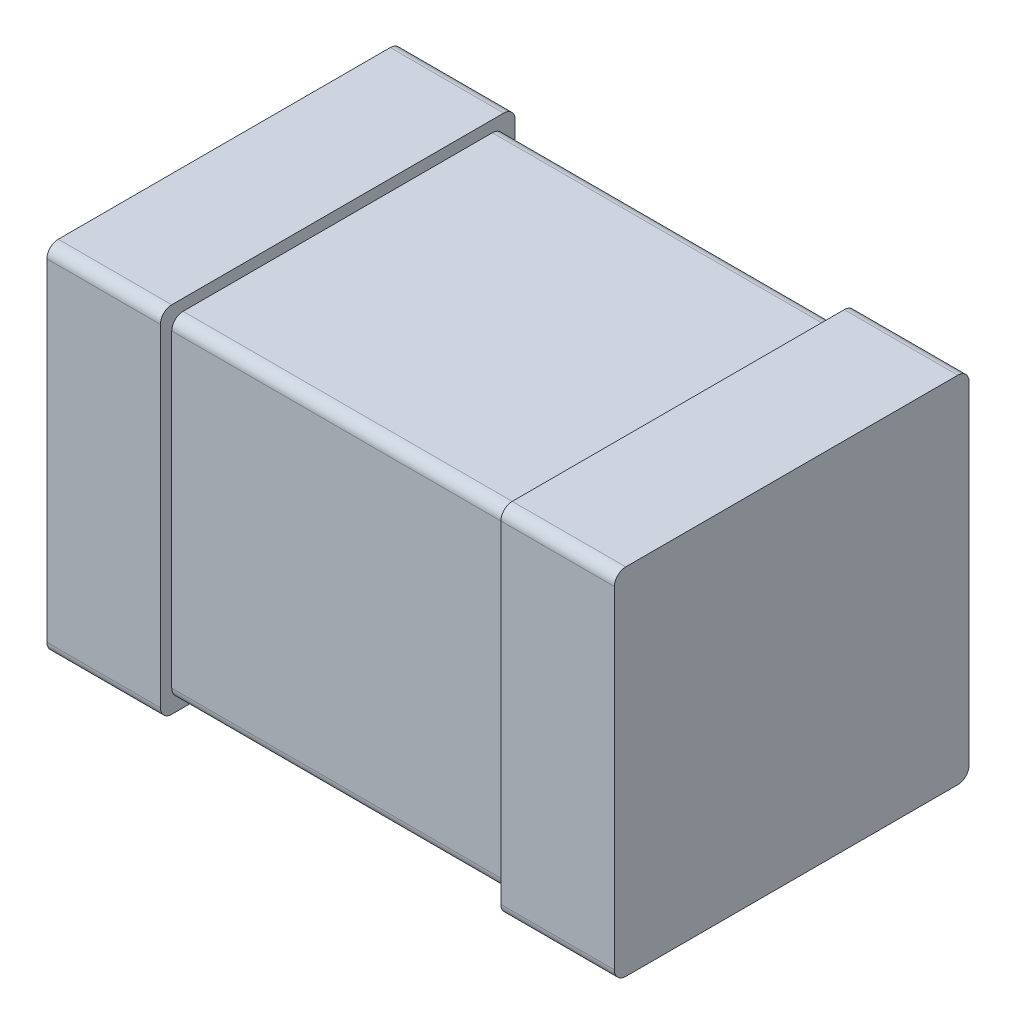
ISO-10303-21;
HEADER;
FILE_DESCRIPTION(('STEP AP214'),'2;1');
FILE_NAME('part.step','',(''),(''),'','','');
FILE_SCHEMA(('AUTOMOTIVE_DESIGN { 1 0 10303 214 1 1 1 1 }'));
ENDSEC;
DATA;
#1=APPLICATION_CONTEXT('core data for automotive mechanical design processes');
#2=APPLICATION_PROTOCOL_DEFINITION('international standard','automotive_design',2000,#1);
#3=PRODUCT_CONTEXT('',#1,'mechanical');
#4=PRODUCT('Part','Part','',(#3));
#5=PRODUCT_RELATED_PRODUCT_CATEGORY('part','',(#4));
#6=PRODUCT_DEFINITION_FORMATION('','',#4);
#7=PRODUCT_DEFINITION_CONTEXT('part definition',#1,'design');
#8=PRODUCT_DEFINITION('design','',#6,#7);
#9=PRODUCT_DEFINITION_SHAPE('','',#8);
#10=(LENGTH_UNIT() NAMED_UNIT(*) SI_UNIT(.MILLI.,.METRE.));
#11=(NAMED_UNIT(*) PLANE_ANGLE_UNIT() SI_UNIT($,.RADIAN.));
#12=(NAMED_UNIT(*) SI_UNIT($,.STERADIAN.) SOLID_ANGLE_UNIT());
#13=UNCERTAINTY_MEASURE_WITH_UNIT(LENGTH_MEASURE(1.E-05),#10,'distance_accuracy_value','');
#14=(GEOMETRIC_REPRESENTATION_CONTEXT(3) GLOBAL_UNCERTAINTY_ASSIGNED_CONTEXT((#13)) GLOBAL_UNIT_ASSIGNED_CONTEXT((#10,
#11,#12)) REPRESENTATION_CONTEXT('',''));
#15=CARTESIAN_POINT('',(0.,0.,0.));
#16=DIRECTION('',(0.,0.,1.));
#17=DIRECTION('',(1.,0.,0.));
#18=AXIS2_PLACEMENT_3D('',#15,#16,#17);
#19=CARTESIAN_POINT('',(1.,0.625,0.));
#20=DIRECTION('',(1.,0.,0.));
#21=DIRECTION('',(0.,0.,1.));
#22=AXIS2_PLACEMENT_3D('',#19,#20,#21);
#23=PLANE('',#22);
#24=DIRECTION('',(0.,1.,0.));
#25=VECTOR('',#24,1.);
#26=CARTESIAN_POINT('',(1.,0.,1.25));
#27=LINE('',#26,#25);
#28=CARTESIAN_POINT('',(1.,-0.585,1.25));
#29=VERTEX_POINT('',#28);
#30=CARTESIAN_POINT('',(1.,0.585,1.25));
#31=VERTEX_POINT('',#30);
#32=EDGE_CURVE('E201',#29,#31,#27,.T.);
#33=ORIENTED_EDGE('',*,*,#32,.F.);
#34=CARTESIAN_POINT('',(1.,-0.585,1.21));
#35=DIRECTION('',(1.,0.,0.));
#36=DIRECTION('',(0.,0.,-1.));
#37=AXIS2_PLACEMENT_3D('',#34,#35,#36);
#38=CIRCLE('',#37,0.0400000000000016);
#39=CARTESIAN_POINT('',(1.,-0.625,1.21));
#40=VERTEX_POINT('',#39);
#41=EDGE_CURVE('E188',#40,#29,#38,.F.);
#42=ORIENTED_EDGE('',*,*,#41,.F.);
#43=DIRECTION('',(0.,0.,-1.));
#44=VECTOR('',#43,1.);
#45=CARTESIAN_POINT('',(1.,-0.625,0.625));
#46=LINE('',#45,#44);
#47=CARTESIAN_POINT('',(1.,-0.625,0.04));
#48=VERTEX_POINT('',#47);
#49=EDGE_CURVE('E185',#40,#48,#46,.T.);
#50=ORIENTED_EDGE('',*,*,#49,.T.);
#51=CARTESIAN_POINT('',(1.,-0.585,0.04));
#52=DIRECTION('',(1.,0.,0.));
#53=DIRECTION('',(0.,0.,-1.));
#54=AXIS2_PLACEMENT_3D('',#51,#52,#53);
#55=CIRCLE('',#54,0.0400000000000015);
#56=CARTESIAN_POINT('',(1.,-0.585,0.));
#57=VERTEX_POINT('',#56);
#58=EDGE_CURVE('E21',#57,#48,#55,.F.);
#59=ORIENTED_EDGE('',*,*,#58,.F.);
#60=DIRECTION('',(0.,1.,0.));
#61=VECTOR('',#60,1.);
#62=CARTESIAN_POINT('',(1.,0.,0.));
#63=LINE('',#62,#61);
#64=CARTESIAN_POINT('',(1.,0.585,0.));
#65=VERTEX_POINT('',#64);
#66=EDGE_CURVE('E197',#57,#65,#63,.T.);
#67=ORIENTED_EDGE('',*,*,#66,.T.);
#68=CARTESIAN_POINT('',(1.,0.585,0.04));
#69=DIRECTION('',(1.,0.,0.));
#70=DIRECTION('',(0.,0.,-1.));
#71=AXIS2_PLACEMENT_3D('',#68,#69,#70);
#72=CIRCLE('',#71,0.0400000000000015);
#73=CARTESIAN_POINT('',(1.,0.625,0.04));
#74=VERTEX_POINT('',#73);
#75=EDGE_CURVE('E209',#74,#65,#72,.F.);
#76=ORIENTED_EDGE('',*,*,#75,.F.);
#77=DIRECTION('',(0.,0.,-1.));
#78=VECTOR('',#77,1.);
#79=CARTESIAN_POINT('',(1.,0.625,0.625));
#80=LINE('',#79,#78);
#81=CARTESIAN_POINT('',(1.,0.625,1.21));
#82=VERTEX_POINT('',#81);
#83=EDGE_CURVE('E205',#82,#74,#80,.T.);
#84=ORIENTED_EDGE('',*,*,#83,.F.);
#85=CARTESIAN_POINT('',(1.,0.585,1.21));
#86=DIRECTION('',(1.,0.,0.));
#87=DIRECTION('',(0.,0.,-1.));
#88=AXIS2_PLACEMENT_3D('',#85,#86,#87);
#89=CIRCLE('',#88,0.0400000000000016);
#90=EDGE_CURVE('E283',#31,#82,#89,.F.);
#91=ORIENTED_EDGE('',*,*,#90,.F.);
#92=EDGE_LOOP('',(#33,#42,#50,#59,#67,#76,#84,#91));
#93=FACE_BOUND('',#92,.T.);
#94=ADVANCED_FACE('F17',(#93),#23,.T.);
#95=CARTESIAN_POINT('',(0.6,-0.625,0.04));
#96=DIRECTION('',(0.,1.,0.));
#97=DIRECTION('',(0.,0.,1.));
#98=AXIS2_PLACEMENT_3D('',#95,#96,#97);
#99=PLANE('',#98);
#100=DIRECTION('',(0.,0.,-1.));
#101=VECTOR('',#100,1.);
#102=CARTESIAN_POINT('',(0.6,-0.625,0.625));
#103=LINE('',#102,#101);
#104=CARTESIAN_POINT('',(0.6,-0.625,1.21));
#105=VERTEX_POINT('',#104);
#106=CARTESIAN_POINT('',(0.6,-0.625,0.04));
#107=VERTEX_POINT('',#106);
#108=EDGE_CURVE('E195',#105,#107,#103,.T.);
#109=ORIENTED_EDGE('',*,*,#108,.T.);
#110=DIRECTION('',(-1.,0.,0.));
#111=VECTOR('',#110,1.);
#112=CARTESIAN_POINT('',(0.8,-0.625,0.04));
#113=LINE('',#112,#111);
#114=EDGE_CURVE('E182',#48,#107,#113,.T.);
#115=ORIENTED_EDGE('',*,*,#114,.F.);
#116=ORIENTED_EDGE('',*,*,#49,.F.);
#117=DIRECTION('',(1.,0.,0.));
#118=VECTOR('',#117,1.);
#119=CARTESIAN_POINT('',(0.8,-0.625,1.21));
#120=LINE('',#119,#118);
#121=EDGE_CURVE('E282',#105,#40,#120,.T.);
#122=ORIENTED_EDGE('',*,*,#121,.F.);
#123=EDGE_LOOP('',(#109,#115,#116,#122));
#124=FACE_BOUND('',#123,.T.);
#125=ADVANCED_FACE('F194',(#124),#99,.F.);
#126=CARTESIAN_POINT('',(0.6,-0.585,0.04));
#127=DIRECTION('',(1.,0.,0.));
#128=DIRECTION('',(0.,0.,-1.));
#129=AXIS2_PLACEMENT_3D('',#126,#127,#128);
#130=CYLINDRICAL_SURFACE('',#129,0.0400000000000015);
#131=ORIENTED_EDGE('',*,*,#58,.T.);
#132=ORIENTED_EDGE('',*,*,#114,.T.);
#133=CARTESIAN_POINT('',(0.6,-0.585,0.04));
#134=DIRECTION('',(1.,0.,0.));
#135=DIRECTION('',(0.,0.,-1.));
#136=AXIS2_PLACEMENT_3D('',#133,#134,#135);
#137=CIRCLE('',#136,0.0400000000000015);
#138=CARTESIAN_POINT('',(0.6,-0.585,0.));
#139=VERTEX_POINT('',#138);
#140=EDGE_CURVE('E278',#107,#139,#137,.T.);
#141=ORIENTED_EDGE('',*,*,#140,.T.);
#142=DIRECTION('',(1.,0.,0.));
#143=VECTOR('',#142,1.);
#144=CARTESIAN_POINT('',(0.8,-0.585,0.));
#145=LINE('',#144,#143);
#146=EDGE_CURVE('E184',#139,#57,#145,.T.);
#147=ORIENTED_EDGE('',*,*,#146,.T.);
#148=EDGE_LOOP('',(#131,#132,#141,#147));
#149=FACE_BOUND('',#148,.T.);
#150=ADVANCED_FACE('F179',(#149),#130,.T.);
#151=CARTESIAN_POINT('',(0.6,-0.585,0.));
#152=DIRECTION('',(0.,0.,1.));
#153=DIRECTION('',(1.,0.,0.));
#154=AXIS2_PLACEMENT_3D('',#151,#152,#153);
#155=PLANE('',#154);
#156=ORIENTED_EDGE('',*,*,#66,.F.);
#157=ORIENTED_EDGE('',*,*,#146,.F.);
#158=DIRECTION('',(0.,1.,0.));
#159=VECTOR('',#158,1.);
#160=CARTESIAN_POINT('',(0.6,0.,0.));
#161=LINE('',#160,#159);
#162=CARTESIAN_POINT('',(0.6,0.585,0.));
#163=VERTEX_POINT('',#162);
#164=EDGE_CURVE('E277',#139,#163,#161,.T.);
#165=ORIENTED_EDGE('',*,*,#164,.T.);
#166=DIRECTION('',(-1.,0.,0.));
#167=VECTOR('',#166,1.);
#168=CARTESIAN_POINT('',(0.8,0.585,0.));
#169=LINE('',#168,#167);
#170=EDGE_CURVE('E208',#65,#163,#169,.T.);
#171=ORIENTED_EDGE('',*,*,#170,.F.);
#172=EDGE_LOOP('',(#156,#157,#165,#171));
#173=FACE_BOUND('',#172,.T.);
#174=ADVANCED_FACE('F472',(#173),#155,.F.);
#175=CARTESIAN_POINT('',(0.6,0.585,0.04));
#176=DIRECTION('',(1.,0.,0.));
#177=DIRECTION('',(0.,0.,-1.));
#178=AXIS2_PLACEMENT_3D('',#175,#176,#177);
#179=CYLINDRICAL_SURFACE('',#178,0.0400000000000015);
#180=ORIENTED_EDGE('',*,*,#170,.T.);
#181=CARTESIAN_POINT('',(0.6,0.585,0.04));
#182=DIRECTION('',(1.,0.,0.));
#183=DIRECTION('',(0.,0.,-1.));
#184=AXIS2_PLACEMENT_3D('',#181,#182,#183);
#185=CIRCLE('',#184,0.0400000000000015);
#186=CARTESIAN_POINT('',(0.6,0.625,0.04));
#187=VERTEX_POINT('',#186);
#188=EDGE_CURVE('E274',#163,#187,#185,.T.);
#189=ORIENTED_EDGE('',*,*,#188,.T.);
#190=DIRECTION('',(-1.,0.,0.));
#191=VECTOR('',#190,1.);
#192=CARTESIAN_POINT('',(0.8,0.625,0.04));
#193=LINE('',#192,#191);
#194=EDGE_CURVE('E207',#74,#187,#193,.T.);
#195=ORIENTED_EDGE('',*,*,#194,.F.);
#196=ORIENTED_EDGE('',*,*,#75,.T.);
#197=EDGE_LOOP('',(#180,#189,#195,#196));
#198=FACE_BOUND('',#197,.T.);
#199=ADVANCED_FACE('F468',(#198),#179,.T.);
#200=CARTESIAN_POINT('',(0.6,0.625,0.04));
#201=DIRECTION('',(0.,1.,0.));
#202=DIRECTION('',(0.,0.,1.));
#203=AXIS2_PLACEMENT_3D('',#200,#201,#202);
#204=PLANE('',#203);
#205=DIRECTION('',(0.,0.,1.));
#206=VECTOR('',#205,1.);
#207=CARTESIAN_POINT('',(0.6,0.625,0.625));
#208=LINE('',#207,#206);
#209=CARTESIAN_POINT('',(0.6,0.625,1.21));
#210=VERTEX_POINT('',#209);
#211=EDGE_CURVE('E273',#187,#210,#208,.T.);
#212=ORIENTED_EDGE('',*,*,#211,.T.);
#213=DIRECTION('',(-1.,0.,0.));
#214=VECTOR('',#213,1.);
#215=CARTESIAN_POINT('',(0.8,0.625,1.21));
#216=LINE('',#215,#214);
#217=EDGE_CURVE('E203',#82,#210,#216,.T.);
#218=ORIENTED_EDGE('',*,*,#217,.F.);
#219=ORIENTED_EDGE('',*,*,#83,.T.);
#220=ORIENTED_EDGE('',*,*,#194,.T.);
#221=EDGE_LOOP('',(#212,#218,#219,#220));
#222=FACE_BOUND('',#221,.T.);
#223=ADVANCED_FACE('F464',(#222),#204,.T.);
#224=CARTESIAN_POINT('',(0.6,0.585,1.21));
#225=DIRECTION('',(1.,0.,0.));
#226=DIRECTION('',(0.,0.,-1.));
#227=AXIS2_PLACEMENT_3D('',#224,#225,#226);
#228=CYLINDRICAL_SURFACE('',#227,0.0400000000000016);
#229=ORIENTED_EDGE('',*,*,#90,.T.);
#230=ORIENTED_EDGE('',*,*,#217,.T.);
#231=CARTESIAN_POINT('',(0.6,0.585,1.21));
#232=DIRECTION('',(1.,0.,0.));
#233=DIRECTION('',(0.,0.,-1.));
#234=AXIS2_PLACEMENT_3D('',#231,#232,#233);
#235=CIRCLE('',#234,0.0400000000000016);
#236=CARTESIAN_POINT('',(0.6,0.585,1.25));
#237=VERTEX_POINT('',#236);
#238=EDGE_CURVE('E270',#210,#237,#235,.T.);
#239=ORIENTED_EDGE('',*,*,#238,.T.);
#240=DIRECTION('',(-1.,0.,0.));
#241=VECTOR('',#240,1.);
#242=CARTESIAN_POINT('',(0.8,0.585,1.25));
#243=LINE('',#242,#241);
#244=EDGE_CURVE('E202',#31,#237,#243,.T.);
#245=ORIENTED_EDGE('',*,*,#244,.F.);
#246=EDGE_LOOP('',(#229,#230,#239,#245));
#247=FACE_BOUND('',#246,.T.);
#248=ADVANCED_FACE('F460',(#247),#228,.T.);
#249=CARTESIAN_POINT('',(0.6,-0.585,1.25));
#250=DIRECTION('',(0.,0.,1.));
#251=DIRECTION('',(1.,0.,0.));
#252=AXIS2_PLACEMENT_3D('',#249,#250,#251);
#253=PLANE('',#252);
#254=ORIENTED_EDGE('',*,*,#32,.T.);
#255=ORIENTED_EDGE('',*,*,#244,.T.);
#256=DIRECTION('',(0.,-1.,0.));
#257=VECTOR('',#256,1.);
#258=CARTESIAN_POINT('',(0.6,0.,1.25));
#259=LINE('',#258,#257);
#260=CARTESIAN_POINT('',(0.6,-0.585,1.25));
#261=VERTEX_POINT('',#260);
#262=EDGE_CURVE('E269',#237,#261,#259,.T.);
#263=ORIENTED_EDGE('',*,*,#262,.T.);
#264=DIRECTION('',(-1.,0.,0.));
#265=VECTOR('',#264,1.);
#266=CARTESIAN_POINT('',(0.8,-0.585,1.25));
#267=LINE('',#266,#265);
#268=EDGE_CURVE('E281',#29,#261,#267,.T.);
#269=ORIENTED_EDGE('',*,*,#268,.F.);
#270=EDGE_LOOP('',(#254,#255,#263,#269));
#271=FACE_BOUND('',#270,.T.);
#272=ADVANCED_FACE('F456',(#271),#253,.T.);
#273=CARTESIAN_POINT('',(0.6,-0.585,1.21));
#274=DIRECTION('',(1.,0.,0.));
#275=DIRECTION('',(0.,0.,-1.));
#276=AXIS2_PLACEMENT_3D('',#273,#274,#275);
#277=CYLINDRICAL_SURFACE('',#276,0.0400000000000016);
#278=ORIENTED_EDGE('',*,*,#268,.T.);
#279=CARTESIAN_POINT('',(0.6,-0.585,1.21));
#280=DIRECTION('',(1.,0.,0.));
#281=DIRECTION('',(0.,0.,-1.));
#282=AXIS2_PLACEMENT_3D('',#279,#280,#281);
#283=CIRCLE('',#282,0.0400000000000016);
#284=EDGE_CURVE('E266',#261,#105,#283,.T.);
#285=ORIENTED_EDGE('',*,*,#284,.T.);
#286=ORIENTED_EDGE('',*,*,#121,.T.);
#287=ORIENTED_EDGE('',*,*,#41,.T.);
#288=EDGE_LOOP('',(#278,#285,#286,#287));
#289=FACE_BOUND('',#288,.T.);
#290=ADVANCED_FACE('F452',(#289),#277,.T.);
#291=CARTESIAN_POINT('',(0.6,0.625,0.));
#292=DIRECTION('',(1.,0.,0.));
#293=DIRECTION('',(0.,0.,1.));
#294=AXIS2_PLACEMENT_3D('',#291,#292,#293);
#295=PLANE('',#294);
#296=CARTESIAN_POINT('',(0.6,0.545,0.08));
#297=DIRECTION('',(1.,0.,0.));
#298=DIRECTION('',(0.,0.,-1.));
#299=AXIS2_PLACEMENT_3D('',#296,#297,#298);
#300=CIRCLE('',#299,0.0400000000000014);
#301=CARTESIAN_POINT('',(0.6,0.585,0.08));
#302=VERTEX_POINT('',#301);
#303=CARTESIAN_POINT('',(0.6,0.545,0.04));
#304=VERTEX_POINT('',#303);
#305=EDGE_CURVE('E251',#302,#304,#300,.F.);
#306=ORIENTED_EDGE('',*,*,#305,.F.);
#307=DIRECTION('',(0.,0.,-1.));
#308=VECTOR('',#307,1.);
#309=CARTESIAN_POINT('',(0.6,0.585,0.625));
#310=LINE('',#309,#308);
#311=CARTESIAN_POINT('',(0.6,0.585,1.17));
#312=VERTEX_POINT('',#311);
#313=EDGE_CURVE('E257',#312,#302,#310,.T.);
#314=ORIENTED_EDGE('',*,*,#313,.F.);
#315=CARTESIAN_POINT('',(0.6,0.545,1.17));
#316=DIRECTION('',(1.,0.,0.));
#317=DIRECTION('',(0.,0.,-1.));
#318=AXIS2_PLACEMENT_3D('',#315,#316,#317);
#319=CIRCLE('',#318,0.0400000000000015);
#320=CARTESIAN_POINT('',(0.6,0.545,1.21));
#321=VERTEX_POINT('',#320);
#322=EDGE_CURVE('E255',#321,#312,#319,.F.);
#323=ORIENTED_EDGE('',*,*,#322,.F.);
#324=DIRECTION('',(0.,1.,0.));
#325=VECTOR('',#324,1.);
#326=CARTESIAN_POINT('',(0.6,0.,1.21));
#327=LINE('',#326,#325);
#328=CARTESIAN_POINT('',(0.6,-0.545,1.21));
#329=VERTEX_POINT('',#328);
#330=EDGE_CURVE('E298',#329,#321,#327,.T.);
#331=ORIENTED_EDGE('',*,*,#330,.F.);
#332=CARTESIAN_POINT('',(0.6,-0.545,1.17));
#333=DIRECTION('',(1.,0.,0.));
#334=DIRECTION('',(0.,0.,-1.));
#335=AXIS2_PLACEMENT_3D('',#332,#333,#334);
#336=CIRCLE('',#335,0.0400000000000015);
#337=CARTESIAN_POINT('',(0.6,-0.585,1.17));
#338=VERTEX_POINT('',#337);
#339=EDGE_CURVE('E259',#338,#329,#336,.F.);
#340=ORIENTED_EDGE('',*,*,#339,.F.);
#341=DIRECTION('',(0.,0.,-1.));
#342=VECTOR('',#341,1.);
#343=CARTESIAN_POINT('',(0.6,-0.585,0.625));
#344=LINE('',#343,#342);
#345=CARTESIAN_POINT('',(0.6,-0.585,0.08));
#346=VERTEX_POINT('',#345);
#347=EDGE_CURVE('E265',#338,#346,#344,.T.);
#348=ORIENTED_EDGE('',*,*,#347,.T.);
#349=CARTESIAN_POINT('',(0.6,-0.545,0.08));
#350=DIRECTION('',(1.,0.,0.));
#351=DIRECTION('',(0.,0.,-1.));
#352=AXIS2_PLACEMENT_3D('',#349,#350,#351);
#353=CIRCLE('',#352,0.0400000000000014);
#354=CARTESIAN_POINT('',(0.6,-0.545,0.04));
#355=VERTEX_POINT('',#354);
#356=EDGE_CURVE('E263',#355,#346,#353,.F.);
#357=ORIENTED_EDGE('',*,*,#356,.F.);
#358=DIRECTION('',(0.,1.,0.));
#359=VECTOR('',#358,1.);
#360=CARTESIAN_POINT('',(0.6,0.,0.04));
#361=LINE('',#360,#359);
#362=EDGE_CURVE('E309',#355,#304,#361,.T.);
#363=ORIENTED_EDGE('',*,*,#362,.T.);
#364=EDGE_LOOP('',(#306,#314,#323,#331,#340,#348,#357,#363));
#365=FACE_BOUND('',#364,.T.);
#366=ORIENTED_EDGE('',*,*,#262,.F.);
#367=ORIENTED_EDGE('',*,*,#238,.F.);
#368=ORIENTED_EDGE('',*,*,#211,.F.);
#369=ORIENTED_EDGE('',*,*,#188,.F.);
#370=ORIENTED_EDGE('',*,*,#164,.F.);
#371=ORIENTED_EDGE('',*,*,#140,.F.);
#372=ORIENTED_EDGE('',*,*,#108,.F.);
#373=ORIENTED_EDGE('',*,*,#284,.F.);
#374=EDGE_LOOP('',(#366,#367,#368,#369,#370,#371,#372,#373));
#375=FACE_BOUND('',#374,.T.);
#376=ADVANCED_FACE('F448',(#365,#375),#295,.F.);
#377=CARTESIAN_POINT('',(-0.6,-0.545,0.08));
#378=DIRECTION('',(1.,0.,0.));
#379=DIRECTION('',(0.,0.,-1.));
#380=AXIS2_PLACEMENT_3D('',#377,#378,#379);
#381=CYLINDRICAL_SURFACE('',#380,0.0400000000000014);
#382=ORIENTED_EDGE('',*,*,#356,.T.);
#383=DIRECTION('',(-1.,0.,0.));
#384=VECTOR('',#383,1.);
#385=CARTESIAN_POINT('',(0.,-0.585,0.08));
#386=LINE('',#385,#384);
#387=CARTESIAN_POINT('',(-0.6,-0.585,0.08));
#388=VERTEX_POINT('',#387);
#389=EDGE_CURVE('E297',#346,#388,#386,.T.);
#390=ORIENTED_EDGE('',*,*,#389,.T.);
#391=CARTESIAN_POINT('',(-0.6,-0.545,0.08));
#392=DIRECTION('',(1.,0.,0.));
#393=DIRECTION('',(0.,0.,-1.));
#394=AXIS2_PLACEMENT_3D('',#391,#392,#393);
#395=CIRCLE('',#394,0.0400000000000014);
#396=CARTESIAN_POINT('',(-0.6,-0.545,0.04));
#397=VERTEX_POINT('',#396);
#398=EDGE_CURVE('E248',#397,#388,#395,.F.);
#399=ORIENTED_EDGE('',*,*,#398,.F.);
#400=DIRECTION('',(1.,0.,0.));
#401=VECTOR('',#400,1.);
#402=CARTESIAN_POINT('',(0.,-0.545,0.04));
#403=LINE('',#402,#401);
#404=EDGE_CURVE('E253',#397,#355,#403,.T.);
#405=ORIENTED_EDGE('',*,*,#404,.T.);
#406=EDGE_LOOP('',(#382,#390,#399,#405));
#407=FACE_BOUND('',#406,.T.);
#408=ADVANCED_FACE('F444',(#407),#381,.T.);
#409=CARTESIAN_POINT('',(-0.6,-0.585,0.08));
#410=DIRECTION('',(0.,1.,0.));
#411=DIRECTION('',(0.,0.,1.));
#412=AXIS2_PLACEMENT_3D('',#409,#410,#411);
#413=PLANE('',#412);
#414=DIRECTION('',(0.,0.,1.));
#415=VECTOR('',#414,1.);
#416=CARTESIAN_POINT('',(-0.6,-0.585,0.625));
#417=LINE('',#416,#415);
#418=CARTESIAN_POINT('',(-0.6,-0.585,1.17));
#419=VERTEX_POINT('',#418);
#420=EDGE_CURVE('E247',#388,#419,#417,.T.);
#421=ORIENTED_EDGE('',*,*,#420,.F.);
#422=ORIENTED_EDGE('',*,*,#389,.F.);
#423=ORIENTED_EDGE('',*,*,#347,.F.);
#424=DIRECTION('',(1.,0.,0.));
#425=VECTOR('',#424,1.);
#426=CARTESIAN_POINT('',(0.,-0.585,1.17));
#427=LINE('',#426,#425);
#428=EDGE_CURVE('E262',#419,#338,#427,.T.);
#429=ORIENTED_EDGE('',*,*,#428,.F.);
#430=EDGE_LOOP('',(#421,#422,#423,#429));
#431=FACE_BOUND('',#430,.T.);
#432=ADVANCED_FACE('F440',(#431),#413,.F.);
#433=CARTESIAN_POINT('',(-0.6,-0.545,1.17));
#434=DIRECTION('',(1.,0.,0.));
#435=DIRECTION('',(0.,0.,-1.));
#436=AXIS2_PLACEMENT_3D('',#433,#434,#435);
#437=CYLINDRICAL_SURFACE('',#436,0.0400000000000015);
#438=DIRECTION('',(1.,0.,0.));
#439=VECTOR('',#438,1.);
#440=CARTESIAN_POINT('',(0.,-0.545,1.21));
#441=LINE('',#440,#439);
#442=CARTESIAN_POINT('',(-0.6,-0.545,1.21));
#443=VERTEX_POINT('',#442);
#444=EDGE_CURVE('E261',#443,#329,#441,.T.);
#445=ORIENTED_EDGE('',*,*,#444,.F.);
#446=CARTESIAN_POINT('',(-0.6,-0.545,1.17));
#447=DIRECTION('',(1.,0.,0.));
#448=DIRECTION('',(0.,0.,-1.));
#449=AXIS2_PLACEMENT_3D('',#446,#447,#448);
#450=CIRCLE('',#449,0.0400000000000015);
#451=EDGE_CURVE('E245',#419,#443,#450,.F.);
#452=ORIENTED_EDGE('',*,*,#451,.F.);
#453=ORIENTED_EDGE('',*,*,#428,.T.);
#454=ORIENTED_EDGE('',*,*,#339,.T.);
#455=EDGE_LOOP('',(#445,#452,#453,#454));
#456=FACE_BOUND('',#455,.T.);
#457=ADVANCED_FACE('F436',(#456),#437,.T.);
#458=CARTESIAN_POINT('',(-0.6,-0.545,1.21));
#459=DIRECTION('',(0.,0.,1.));
#460=DIRECTION('',(1.,0.,0.));
#461=AXIS2_PLACEMENT_3D('',#458,#459,#460);
#462=PLANE('',#461);
#463=ORIENTED_EDGE('',*,*,#330,.T.);
#464=DIRECTION('',(1.,0.,0.));
#465=VECTOR('',#464,1.);
#466=CARTESIAN_POINT('',(0.,0.545,1.21));
#467=LINE('',#466,#465);
#468=CARTESIAN_POINT('',(-0.6,0.545,1.21));
#469=VERTEX_POINT('',#468);
#470=EDGE_CURVE('E258',#469,#321,#467,.T.);
#471=ORIENTED_EDGE('',*,*,#470,.F.);
#472=DIRECTION('',(0.,1.,0.));
#473=VECTOR('',#472,1.);
#474=CARTESIAN_POINT('',(-0.6,0.,1.21));
#475=LINE('',#474,#473);
#476=EDGE_CURVE('E244',#443,#469,#475,.T.);
#477=ORIENTED_EDGE('',*,*,#476,.F.);
#478=ORIENTED_EDGE('',*,*,#444,.T.);
#479=EDGE_LOOP('',(#463,#471,#477,#478));
#480=FACE_BOUND('',#479,.T.);
#481=ADVANCED_FACE('F432',(#480),#462,.T.);
#482=CARTESIAN_POINT('',(-0.6,0.545,1.17));
#483=DIRECTION('',(1.,0.,0.));
#484=DIRECTION('',(0.,0.,-1.));
#485=AXIS2_PLACEMENT_3D('',#482,#483,#484);
#486=CYLINDRICAL_SURFACE('',#485,0.0400000000000015);
#487=ORIENTED_EDGE('',*,*,#322,.T.);
#488=DIRECTION('',(1.,0.,0.));
#489=VECTOR('',#488,1.);
#490=CARTESIAN_POINT('',(0.,0.585,1.17));
#491=LINE('',#490,#489);
#492=CARTESIAN_POINT('',(-0.6,0.585,1.17));
#493=VERTEX_POINT('',#492);
#494=EDGE_CURVE('E301',#493,#312,#491,.T.);
#495=ORIENTED_EDGE('',*,*,#494,.F.);
#496=CARTESIAN_POINT('',(-0.6,0.545,1.17));
#497=DIRECTION('',(1.,0.,0.));
#498=DIRECTION('',(0.,0.,-1.));
#499=AXIS2_PLACEMENT_3D('',#496,#497,#498);
#500=CIRCLE('',#499,0.0400000000000015);
#501=EDGE_CURVE('E242',#469,#493,#500,.F.);
#502=ORIENTED_EDGE('',*,*,#501,.F.);
#503=ORIENTED_EDGE('',*,*,#470,.T.);
#504=EDGE_LOOP('',(#487,#495,#502,#503));
#505=FACE_BOUND('',#504,.T.);
#506=ADVANCED_FACE('F428',(#505),#486,.T.);
#507=CARTESIAN_POINT('',(-0.6,0.585,0.08));
#508=DIRECTION('',(0.,1.,0.));
#509=DIRECTION('',(0.,0.,1.));
#510=AXIS2_PLACEMENT_3D('',#507,#508,#509);
#511=PLANE('',#510);
#512=DIRECTION('',(0.,0.,-1.));
#513=VECTOR('',#512,1.);
#514=CARTESIAN_POINT('',(-0.6,0.585,0.625));
#515=LINE('',#514,#513);
#516=CARTESIAN_POINT('',(-0.6,0.585,0.08));
#517=VERTEX_POINT('',#516);
#518=EDGE_CURVE('E241',#493,#517,#515,.T.);
#519=ORIENTED_EDGE('',*,*,#518,.F.);
#520=ORIENTED_EDGE('',*,*,#494,.T.);
#521=ORIENTED_EDGE('',*,*,#313,.T.);
#522=DIRECTION('',(1.,0.,0.));
#523=VECTOR('',#522,1.);
#524=CARTESIAN_POINT('',(0.,0.585,0.08));
#525=LINE('',#524,#523);
#526=EDGE_CURVE('E254',#517,#302,#525,.T.);
#527=ORIENTED_EDGE('',*,*,#526,.F.);
#528=EDGE_LOOP('',(#519,#520,#521,#527));
#529=FACE_BOUND('',#528,.T.);
#530=ADVANCED_FACE('F424',(#529),#511,.T.);
#531=CARTESIAN_POINT('',(-0.6,0.545,0.08));
#532=DIRECTION('',(1.,0.,0.));
#533=DIRECTION('',(0.,0.,-1.));
#534=AXIS2_PLACEMENT_3D('',#531,#532,#533);
#535=CYLINDRICAL_SURFACE('',#534,0.0400000000000014);
#536=DIRECTION('',(-1.,0.,0.));
#537=VECTOR('',#536,1.);
#538=CARTESIAN_POINT('',(0.,0.545,0.04));
#539=LINE('',#538,#537);
#540=CARTESIAN_POINT('',(-0.6,0.545,0.04));
#541=VERTEX_POINT('',#540);
#542=EDGE_CURVE('E250',#304,#541,#539,.T.);
#543=ORIENTED_EDGE('',*,*,#542,.T.);
#544=CARTESIAN_POINT('',(-0.6,0.545,0.08));
#545=DIRECTION('',(1.,0.,0.));
#546=DIRECTION('',(0.,0.,-1.));
#547=AXIS2_PLACEMENT_3D('',#544,#545,#546);
#548=CIRCLE('',#547,0.0400000000000014);
#549=EDGE_CURVE('E238',#517,#541,#548,.F.);
#550=ORIENTED_EDGE('',*,*,#549,.F.);
#551=ORIENTED_EDGE('',*,*,#526,.T.);
#552=ORIENTED_EDGE('',*,*,#305,.T.);
#553=EDGE_LOOP('',(#543,#550,#551,#552));
#554=FACE_BOUND('',#553,.T.);
#555=ADVANCED_FACE('F420',(#554),#535,.T.);
#556=CARTESIAN_POINT('',(-0.6,-0.545,0.04));
#557=DIRECTION('',(0.,0.,1.));
#558=DIRECTION('',(1.,0.,0.));
#559=AXIS2_PLACEMENT_3D('',#556,#557,#558);
#560=PLANE('',#559);
#561=ORIENTED_EDGE('',*,*,#362,.F.);
#562=ORIENTED_EDGE('',*,*,#404,.F.);
#563=DIRECTION('',(0.,-1.,0.));
#564=VECTOR('',#563,1.);
#565=CARTESIAN_POINT('',(-0.6,0.,0.04));
#566=LINE('',#565,#564);
#567=EDGE_CURVE('E240',#541,#397,#566,.T.);
#568=ORIENTED_EDGE('',*,*,#567,.F.);
#569=ORIENTED_EDGE('',*,*,#542,.F.);
#570=EDGE_LOOP('',(#561,#562,#568,#569));
#571=FACE_BOUND('',#570,.T.);
#572=ADVANCED_FACE('F416',(#571),#560,.F.);
#573=CARTESIAN_POINT('',(-0.6,0.625,0.));
#574=DIRECTION('',(1.,0.,0.));
#575=DIRECTION('',(0.,0.,1.));
#576=AXIS2_PLACEMENT_3D('',#573,#574,#575);
#577=PLANE('',#576);
#578=ORIENTED_EDGE('',*,*,#549,.T.);
#579=ORIENTED_EDGE('',*,*,#567,.T.);
#580=ORIENTED_EDGE('',*,*,#398,.T.);
#581=ORIENTED_EDGE('',*,*,#420,.T.);
#582=ORIENTED_EDGE('',*,*,#451,.T.);
#583=ORIENTED_EDGE('',*,*,#476,.T.);
#584=ORIENTED_EDGE('',*,*,#501,.T.);
#585=ORIENTED_EDGE('',*,*,#518,.T.);
#586=EDGE_LOOP('',(#578,#579,#580,#581,#582,#583,#584,#585));
#587=FACE_BOUND('',#586,.T.);
#588=DIRECTION('',(0.,1.,0.));
#589=VECTOR('',#588,1.);
#590=CARTESIAN_POINT('',(-0.6,0.,1.25));
#591=LINE('',#590,#589);
#592=CARTESIAN_POINT('',(-0.6,-0.585,1.25));
#593=VERTEX_POINT('',#592);
#594=CARTESIAN_POINT('',(-0.6,0.585,1.25));
#595=VERTEX_POINT('',#594);
#596=EDGE_CURVE('E340',#593,#595,#591,.T.);
#597=ORIENTED_EDGE('',*,*,#596,.F.);
#598=CARTESIAN_POINT('',(-0.6,-0.585,1.21));
#599=DIRECTION('',(1.,0.,0.));
#600=DIRECTION('',(0.,0.,-1.));
#601=AXIS2_PLACEMENT_3D('',#598,#599,#600);
#602=CIRCLE('',#601,0.0400000000000016);
#603=CARTESIAN_POINT('',(-0.6,-0.625,1.21));
#604=VERTEX_POINT('',#603);
#605=EDGE_CURVE('E223',#604,#593,#602,.F.);
#606=ORIENTED_EDGE('',*,*,#605,.F.);
#607=DIRECTION('',(0.,0.,-1.));
#608=VECTOR('',#607,1.);
#609=CARTESIAN_POINT('',(-0.6,-0.625,0.625));
#610=LINE('',#609,#608);
#611=CARTESIAN_POINT('',(-0.6,-0.625,0.04));
#612=VERTEX_POINT('',#611);
#613=EDGE_CURVE('E237',#604,#612,#610,.T.);
#614=ORIENTED_EDGE('',*,*,#613,.T.);
#615=CARTESIAN_POINT('',(-0.6,-0.585,0.04));
#616=DIRECTION('',(1.,0.,0.));
#617=DIRECTION('',(0.,0.,-1.));
#618=AXIS2_PLACEMENT_3D('',#615,#616,#617);
#619=CIRCLE('',#618,0.0400000000000015);
#620=CARTESIAN_POINT('',(-0.6,-0.585,0.));
#621=VERTEX_POINT('',#620);
#622=EDGE_CURVE('E234',#621,#612,#619,.F.);
#623=ORIENTED_EDGE('',*,*,#622,.F.);
#624=DIRECTION('',(0.,1.,0.));
#625=VECTOR('',#624,1.);
#626=CARTESIAN_POINT('',(-0.6,0.,0.));
#627=LINE('',#626,#625);
#628=CARTESIAN_POINT('',(-0.6,0.585,0.));
#629=VERTEX_POINT('',#628);
#630=EDGE_CURVE('E233',#621,#629,#627,.T.);
#631=ORIENTED_EDGE('',*,*,#630,.T.);
#632=CARTESIAN_POINT('',(-0.6,0.585,0.04));
#633=DIRECTION('',(1.,0.,0.));
#634=DIRECTION('',(0.,0.,-1.));
#635=AXIS2_PLACEMENT_3D('',#632,#633,#634);
#636=CIRCLE('',#635,0.0400000000000015);
#637=CARTESIAN_POINT('',(-0.6,0.625,0.04));
#638=VERTEX_POINT('',#637);
#639=EDGE_CURVE('E230',#638,#629,#636,.F.);
#640=ORIENTED_EDGE('',*,*,#639,.F.);
#641=DIRECTION('',(0.,0.,-1.));
#642=VECTOR('',#641,1.);
#643=CARTESIAN_POINT('',(-0.6,0.625,0.625));
#644=LINE('',#643,#642);
#645=CARTESIAN_POINT('',(-0.6,0.625,1.21));
#646=VERTEX_POINT('',#645);
#647=EDGE_CURVE('E331',#646,#638,#644,.T.);
#648=ORIENTED_EDGE('',*,*,#647,.F.);
#649=CARTESIAN_POINT('',(-0.6,0.585,1.21));
#650=DIRECTION('',(1.,0.,0.));
#651=DIRECTION('',(0.,0.,-1.));
#652=AXIS2_PLACEMENT_3D('',#649,#650,#651);
#653=CIRCLE('',#652,0.0400000000000016);
#654=EDGE_CURVE('E226',#595,#646,#653,.F.);
#655=ORIENTED_EDGE('',*,*,#654,.F.);
#656=EDGE_LOOP('',(#597,#606,#614,#623,#631,#640,#648,#655));
#657=FACE_BOUND('',#656,.T.);
#658=ADVANCED_FACE('F413',(#587,#657),#577,.T.);
#659=CARTESIAN_POINT('',(-1.,-0.625,0.04));
#660=DIRECTION('',(0.,1.,0.));
#661=DIRECTION('',(0.,0.,1.));
#662=AXIS2_PLACEMENT_3D('',#659,#660,#661);
#663=PLANE('',#662);
#664=DIRECTION('',(0.,0.,-1.));
#665=VECTOR('',#664,1.);
#666=CARTESIAN_POINT('',(-1.,-0.625,0.625));
#667=LINE('',#666,#665);
#668=CARTESIAN_POINT('',(-1.,-0.625,1.21));
#669=VERTEX_POINT('',#668);
#670=CARTESIAN_POINT('',(-1.,-0.625,0.04));
#671=VERTEX_POINT('',#670);
#672=EDGE_CURVE('E222',#669,#671,#667,.T.);
#673=ORIENTED_EDGE('',*,*,#672,.T.);
#674=DIRECTION('',(-1.,0.,0.));
#675=VECTOR('',#674,1.);
#676=CARTESIAN_POINT('',(-0.8,-0.625,0.04));
#677=LINE('',#676,#675);
#678=EDGE_CURVE('E236',#612,#671,#677,.T.);
#679=ORIENTED_EDGE('',*,*,#678,.F.);
#680=ORIENTED_EDGE('',*,*,#613,.F.);
#681=DIRECTION('',(1.,0.,0.));
#682=VECTOR('',#681,1.);
#683=CARTESIAN_POINT('',(-0.8,-0.625,1.21));
#684=LINE('',#683,#682);
#685=EDGE_CURVE('E225',#669,#604,#684,.T.);
#686=ORIENTED_EDGE('',*,*,#685,.F.);
#687=EDGE_LOOP('',(#673,#679,#680,#686));
#688=FACE_BOUND('',#687,.T.);
#689=ADVANCED_FACE('F389',(#688),#663,.F.);
#690=CARTESIAN_POINT('',(-1.,-0.585,0.04));
#691=DIRECTION('',(1.,0.,0.));
#692=DIRECTION('',(0.,0.,-1.));
#693=AXIS2_PLACEMENT_3D('',#690,#691,#692);
#694=CYLINDRICAL_SURFACE('',#693,0.0400000000000015);
#695=ORIENTED_EDGE('',*,*,#622,.T.);
#696=ORIENTED_EDGE('',*,*,#678,.T.);
#697=CARTESIAN_POINT('',(-1.,-0.585,0.04));
#698=DIRECTION('',(1.,0.,0.));
#699=DIRECTION('',(0.,0.,-1.));
#700=AXIS2_PLACEMENT_3D('',#697,#698,#699);
#701=CIRCLE('',#700,0.0400000000000015);
#702=CARTESIAN_POINT('',(-1.,-0.585,0.));
#703=VERTEX_POINT('',#702);
#704=EDGE_CURVE('E219',#671,#703,#701,.T.);
#705=ORIENTED_EDGE('',*,*,#704,.T.);
#706=DIRECTION('',(1.,0.,0.));
#707=VECTOR('',#706,1.);
#708=CARTESIAN_POINT('',(-0.8,-0.585,0.));
#709=LINE('',#708,#707);
#710=EDGE_CURVE('E330',#703,#621,#709,.T.);
#711=ORIENTED_EDGE('',*,*,#710,.T.);
#712=EDGE_LOOP('',(#695,#696,#705,#711));
#713=FACE_BOUND('',#712,.T.);
#714=ADVANCED_FACE('F386',(#713),#694,.T.);
#715=CARTESIAN_POINT('',(-1.,-0.585,0.));
#716=DIRECTION('',(0.,0.,1.));
#717=DIRECTION('',(1.,0.,0.));
#718=AXIS2_PLACEMENT_3D('',#715,#716,#717);
#719=PLANE('',#718);
#720=ORIENTED_EDGE('',*,*,#630,.F.);
#721=ORIENTED_EDGE('',*,*,#710,.F.);
#722=DIRECTION('',(0.,1.,0.));
#723=VECTOR('',#722,1.);
#724=CARTESIAN_POINT('',(-1.,0.,0.));
#725=LINE('',#724,#723);
#726=CARTESIAN_POINT('',(-1.,0.585,0.));
#727=VERTEX_POINT('',#726);
#728=EDGE_CURVE('E218',#703,#727,#725,.T.);
#729=ORIENTED_EDGE('',*,*,#728,.T.);
#730=DIRECTION('',(-1.,0.,0.));
#731=VECTOR('',#730,1.);
#732=CARTESIAN_POINT('',(-0.8,0.585,0.));
#733=LINE('',#732,#731);
#734=EDGE_CURVE('E232',#629,#727,#733,.T.);
#735=ORIENTED_EDGE('',*,*,#734,.F.);
#736=EDGE_LOOP('',(#720,#721,#729,#735));
#737=FACE_BOUND('',#736,.T.);
#738=ADVANCED_FACE('F383',(#737),#719,.F.);
#739=CARTESIAN_POINT('',(-1.,0.585,0.04));
#740=DIRECTION('',(1.,0.,0.));
#741=DIRECTION('',(0.,0.,-1.));
#742=AXIS2_PLACEMENT_3D('',#739,#740,#741);
#743=CYLINDRICAL_SURFACE('',#742,0.0400000000000015);
#744=ORIENTED_EDGE('',*,*,#734,.T.);
#745=CARTESIAN_POINT('',(-1.,0.585,0.04));
#746=DIRECTION('',(1.,0.,0.));
#747=DIRECTION('',(0.,0.,-1.));
#748=AXIS2_PLACEMENT_3D('',#745,#746,#747);
#749=CIRCLE('',#748,0.0400000000000015);
#750=CARTESIAN_POINT('',(-1.,0.625,0.04));
#751=VERTEX_POINT('',#750);
#752=EDGE_CURVE('E215',#727,#751,#749,.T.);
#753=ORIENTED_EDGE('',*,*,#752,.T.);
#754=DIRECTION('',(-1.,0.,0.));
#755=VECTOR('',#754,1.);
#756=CARTESIAN_POINT('',(-0.8,0.625,0.04));
#757=LINE('',#756,#755);
#758=EDGE_CURVE('E229',#638,#751,#757,.T.);
#759=ORIENTED_EDGE('',*,*,#758,.F.);
#760=ORIENTED_EDGE('',*,*,#639,.T.);
#761=EDGE_LOOP('',(#744,#753,#759,#760));
#762=FACE_BOUND('',#761,.T.);
#763=ADVANCED_FACE('F379',(#762),#743,.T.);
#764=CARTESIAN_POINT('',(-1.,0.625,0.04));
#765=DIRECTION('',(0.,1.,0.));
#766=DIRECTION('',(0.,0.,1.));
#767=AXIS2_PLACEMENT_3D('',#764,#765,#766);
#768=PLANE('',#767);
#769=DIRECTION('',(0.,0.,1.));
#770=VECTOR('',#769,1.);
#771=CARTESIAN_POINT('',(-1.,0.625,0.625));
#772=LINE('',#771,#770);
#773=CARTESIAN_POINT('',(-1.,0.625,1.21));
#774=VERTEX_POINT('',#773);
#775=EDGE_CURVE('E214',#751,#774,#772,.T.);
#776=ORIENTED_EDGE('',*,*,#775,.T.);
#777=DIRECTION('',(-1.,0.,0.));
#778=VECTOR('',#777,1.);
#779=CARTESIAN_POINT('',(-0.8,0.625,1.21));
#780=LINE('',#779,#778);
#781=EDGE_CURVE('E228',#646,#774,#780,.T.);
#782=ORIENTED_EDGE('',*,*,#781,.F.);
#783=ORIENTED_EDGE('',*,*,#647,.T.);
#784=ORIENTED_EDGE('',*,*,#758,.T.);
#785=EDGE_LOOP('',(#776,#782,#783,#784));
#786=FACE_BOUND('',#785,.T.);
#787=ADVANCED_FACE('F373',(#786),#768,.T.);
#788=CARTESIAN_POINT('',(-1.,0.585,1.21));
#789=DIRECTION('',(1.,0.,0.));
#790=DIRECTION('',(0.,0.,-1.));
#791=AXIS2_PLACEMENT_3D('',#788,#789,#790);
#792=CYLINDRICAL_SURFACE('',#791,0.0400000000000016);
#793=ORIENTED_EDGE('',*,*,#654,.T.);
#794=ORIENTED_EDGE('',*,*,#781,.T.);
#795=CARTESIAN_POINT('',(-1.,0.585,1.21));
#796=DIRECTION('',(1.,0.,0.));
#797=DIRECTION('',(0.,0.,-1.));
#798=AXIS2_PLACEMENT_3D('',#795,#796,#797);
#799=CIRCLE('',#798,0.0400000000000016);
#800=CARTESIAN_POINT('',(-1.,0.585,1.25));
#801=VERTEX_POINT('',#800);
#802=EDGE_CURVE('E211',#774,#801,#799,.T.);
#803=ORIENTED_EDGE('',*,*,#802,.T.);
#804=DIRECTION('',(-1.,0.,0.));
#805=VECTOR('',#804,1.);
#806=CARTESIAN_POINT('',(-0.8,0.585,1.25));
#807=LINE('',#806,#805);
#808=EDGE_CURVE('E342',#595,#801,#807,.T.);
#809=ORIENTED_EDGE('',*,*,#808,.F.);
#810=EDGE_LOOP('',(#793,#794,#803,#809));
#811=FACE_BOUND('',#810,.T.);
#812=ADVANCED_FACE('F368',(#811),#792,.T.);
#813=CARTESIAN_POINT('',(-1.,-0.585,1.25));
#814=DIRECTION('',(0.,0.,1.));
#815=DIRECTION('',(1.,0.,0.));
#816=AXIS2_PLACEMENT_3D('',#813,#814,#815);
#817=PLANE('',#816);
#818=ORIENTED_EDGE('',*,*,#596,.T.);
#819=ORIENTED_EDGE('',*,*,#808,.T.);
#820=DIRECTION('',(0.,-1.,0.));
#821=VECTOR('',#820,1.);
#822=CARTESIAN_POINT('',(-1.,0.,1.25));
#823=LINE('',#822,#821);
#824=CARTESIAN_POINT('',(-1.,-0.585,1.25));
#825=VERTEX_POINT('',#824);
#826=EDGE_CURVE('E27',#801,#825,#823,.T.);
#827=ORIENTED_EDGE('',*,*,#826,.T.);
#828=DIRECTION('',(-1.,0.,0.));
#829=VECTOR('',#828,1.);
#830=CARTESIAN_POINT('',(-0.8,-0.585,1.25));
#831=LINE('',#830,#829);
#832=EDGE_CURVE('E35',#593,#825,#831,.T.);
#833=ORIENTED_EDGE('',*,*,#832,.F.);
#834=EDGE_LOOP('',(#818,#819,#827,#833));
#835=FACE_BOUND('',#834,.T.);
#836=ADVANCED_FACE('F362',(#835),#817,.T.);
#837=CARTESIAN_POINT('',(-1.,-0.585,1.21));
#838=DIRECTION('',(1.,0.,0.));
#839=DIRECTION('',(0.,0.,-1.));
#840=AXIS2_PLACEMENT_3D('',#837,#838,#839);
#841=CYLINDRICAL_SURFACE('',#840,0.0400000000000016);
#842=ORIENTED_EDGE('',*,*,#832,.T.);
#843=CARTESIAN_POINT('',(-1.,-0.585,1.21));
#844=DIRECTION('',(1.,0.,0.));
#845=DIRECTION('',(0.,0.,-1.));
#846=AXIS2_PLACEMENT_3D('',#843,#844,#845);
#847=CIRCLE('',#846,0.0400000000000016);
#848=EDGE_CURVE('E11',#825,#669,#847,.T.);
#849=ORIENTED_EDGE('',*,*,#848,.T.);
#850=ORIENTED_EDGE('',*,*,#685,.T.);
#851=ORIENTED_EDGE('',*,*,#605,.T.);
#852=EDGE_LOOP('',(#842,#849,#850,#851));
#853=FACE_BOUND('',#852,.T.);
#854=ADVANCED_FACE('F392',(#853),#841,.T.);
#855=CARTESIAN_POINT('',(-1.,0.625,0.));
#856=DIRECTION('',(1.,0.,0.));
#857=DIRECTION('',(0.,0.,1.));
#858=AXIS2_PLACEMENT_3D('',#855,#856,#857);
#859=PLANE('',#858);
#860=ORIENTED_EDGE('',*,*,#826,.F.);
#861=ORIENTED_EDGE('',*,*,#802,.F.);
#862=ORIENTED_EDGE('',*,*,#775,.F.);
#863=ORIENTED_EDGE('',*,*,#752,.F.);
#864=ORIENTED_EDGE('',*,*,#728,.F.);
#865=ORIENTED_EDGE('',*,*,#704,.F.);
#866=ORIENTED_EDGE('',*,*,#672,.F.);
#867=ORIENTED_EDGE('',*,*,#848,.F.);
#868=EDGE_LOOP('',(#860,#861,#862,#863,#864,#865,#866,#867));
#869=FACE_BOUND('',#868,.T.);
#870=ADVANCED_FACE('F19',(#869),#859,.F.);
#871=CLOSED_SHELL('',(#94,#125,#150,#174,#199,#223,#248,#272,#290,#376,#408,#432,#457,#481,#506,
#530,#555,#572,#658,#689,#714,#738,#763,#787,#812,#836,#854,#870));
#872=MANIFOLD_SOLID_BREP('B1',#871);
#873=ADVANCED_BREP_SHAPE_REPRESENTATION('',(#18,#872),#14);
#874=SHAPE_DEFINITION_REPRESENTATION(#9,#873);
ENDSEC;
END-ISO-10303-21;
